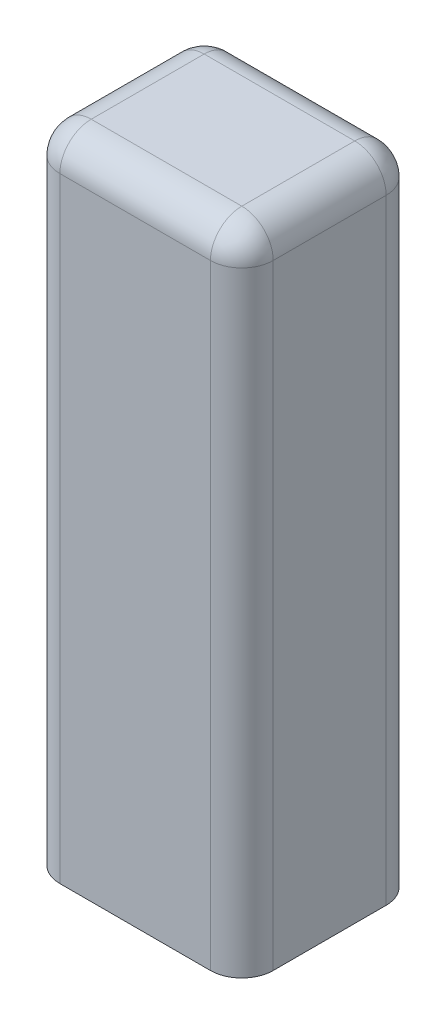
ISO-10303-21;
HEADER;
FILE_DESCRIPTION(('STEP AP214'),'2;1');
FILE_NAME('part.step','',(''),(''),'','','');
FILE_SCHEMA(('AUTOMOTIVE_DESIGN { 1 0 10303 214 1 1 1 1 }'));
ENDSEC;
DATA;
#1=APPLICATION_CONTEXT('core data for automotive mechanical design processes');
#2=APPLICATION_PROTOCOL_DEFINITION('international standard','automotive_design',2000,#1);
#3=PRODUCT_CONTEXT('',#1,'mechanical');
#4=PRODUCT('Part','Part','',(#3));
#5=PRODUCT_RELATED_PRODUCT_CATEGORY('part','',(#4));
#6=PRODUCT_DEFINITION_FORMATION('','',#4);
#7=PRODUCT_DEFINITION_CONTEXT('part definition',#1,'design');
#8=PRODUCT_DEFINITION('design','',#6,#7);
#9=PRODUCT_DEFINITION_SHAPE('','',#8);
#10=(LENGTH_UNIT() NAMED_UNIT(*) SI_UNIT(.MILLI.,.METRE.));
#11=(NAMED_UNIT(*) PLANE_ANGLE_UNIT() SI_UNIT($,.RADIAN.));
#12=(NAMED_UNIT(*) SI_UNIT($,.STERADIAN.) SOLID_ANGLE_UNIT());
#13=UNCERTAINTY_MEASURE_WITH_UNIT(LENGTH_MEASURE(1.E-05),#10,'distance_accuracy_value','');
#14=(GEOMETRIC_REPRESENTATION_CONTEXT(3) GLOBAL_UNCERTAINTY_ASSIGNED_CONTEXT((#13)) GLOBAL_UNIT_ASSIGNED_CONTEXT((#10,
#11,#12)) REPRESENTATION_CONTEXT('',''));
#15=CARTESIAN_POINT('',(0.,0.,0.));
#16=DIRECTION('',(0.,0.,1.));
#17=DIRECTION('',(1.,0.,0.));
#18=AXIS2_PLACEMENT_3D('',#15,#16,#17);
#19=CARTESIAN_POINT('',(39.3425128664854,0.,28.));
#20=DIRECTION('',(0.,1.,0.));
#21=DIRECTION('',(0.,0.,1.));
#22=AXIS2_PLACEMENT_3D('',#19,#20,#21);
#23=PLANE('',#22);
#24=DIRECTION('',(0.,0.,-1.));
#25=VECTOR('',#24,1.);
#26=CARTESIAN_POINT('',(29.,0.,28.));
#27=LINE('',#26,#25);
#28=CARTESIAN_POINT('',(29.,0.,23.));
#29=VERTEX_POINT('',#28);
#30=CARTESIAN_POINT('',(29.,0.,5.));
#31=VERTEX_POINT('',#30);
#32=EDGE_CURVE('E159',#29,#31,#27,.T.);
#33=ORIENTED_EDGE('',*,*,#32,.T.);
#34=DIRECTION('',(1.,0.,0.));
#35=VECTOR('',#34,1.);
#36=CARTESIAN_POINT('',(0.,0.,5.));
#37=LINE('',#36,#35);
#38=CARTESIAN_POINT('',(5.,0.,5.));
#39=VERTEX_POINT('',#38);
#40=EDGE_CURVE('E166',#31,#39,#37,.F.);
#41=ORIENTED_EDGE('',*,*,#40,.T.);
#42=DIRECTION('',(0.,0.,-1.));
#43=VECTOR('',#42,1.);
#44=CARTESIAN_POINT('',(5.,0.,28.));
#45=LINE('',#44,#43);
#46=CARTESIAN_POINT('',(5.,0.,23.));
#47=VERTEX_POINT('',#46);
#48=EDGE_CURVE('E162',#39,#47,#45,.F.);
#49=ORIENTED_EDGE('',*,*,#48,.T.);
#50=DIRECTION('',(1.,0.,0.));
#51=VECTOR('',#50,1.);
#52=CARTESIAN_POINT('',(39.3425128664854,0.,23.));
#53=LINE('',#52,#51);
#54=EDGE_CURVE('E156',#47,#29,#53,.T.);
#55=ORIENTED_EDGE('',*,*,#54,.T.);
#56=EDGE_LOOP('',(#33,#41,#49,#55));
#57=FACE_BOUND('',#56,.T.);
#58=ADVANCED_FACE('F16',(#57),#23,.T.);
#59=CARTESIAN_POINT('',(0.,-75.,28.));
#60=DIRECTION('',(1.,0.,0.));
#61=DIRECTION('',(0.,0.,-1.));
#62=AXIS2_PLACEMENT_3D('',#59,#60,#61);
#63=PLANE('',#62);
#64=DIRECTION('',(0.,0.,-1.));
#65=VECTOR('',#64,1.);
#66=CARTESIAN_POINT('',(0.,-5.,0.));
#67=LINE('',#66,#65);
#68=CARTESIAN_POINT('',(0.,-5.,23.));
#69=VERTEX_POINT('',#68);
#70=CARTESIAN_POINT('',(0.,-5.,5.));
#71=VERTEX_POINT('',#70);
#72=EDGE_CURVE('E146',#69,#71,#67,.T.);
#73=ORIENTED_EDGE('',*,*,#72,.T.);
#74=DIRECTION('',(0.,-1.,0.));
#75=VECTOR('',#74,1.);
#76=CARTESIAN_POINT('',(0.,-75.,5.));
#77=LINE('',#76,#75);
#78=CARTESIAN_POINT('',(0.,-103.,5.));
#79=VERTEX_POINT('',#78);
#80=EDGE_CURVE('E137',#71,#79,#77,.T.);
#81=ORIENTED_EDGE('',*,*,#80,.T.);
#82=DIRECTION('',(0.,0.,-1.));
#83=VECTOR('',#82,1.);
#84=CARTESIAN_POINT('',(0.,-103.,28.));
#85=LINE('',#84,#83);
#86=CARTESIAN_POINT('',(0.,-103.,23.));
#87=VERTEX_POINT('',#86);
#88=EDGE_CURVE('E122',#87,#79,#85,.T.);
#89=ORIENTED_EDGE('',*,*,#88,.F.);
#90=DIRECTION('',(0.,-1.,0.));
#91=VECTOR('',#90,1.);
#92=CARTESIAN_POINT('',(0.,0.,23.));
#93=LINE('',#92,#91);
#94=EDGE_CURVE('E134',#87,#69,#93,.F.);
#95=ORIENTED_EDGE('',*,*,#94,.T.);
#96=EDGE_LOOP('',(#73,#81,#89,#95));
#97=FACE_BOUND('',#96,.T.);
#98=ADVANCED_FACE('F133',(#97),#63,.F.);
#99=CARTESIAN_POINT('',(39.3425128664854,-103.,28.));
#100=DIRECTION('',(0.,1.,0.));
#101=DIRECTION('',(0.,0.,1.));
#102=AXIS2_PLACEMENT_3D('',#99,#100,#101);
#103=PLANE('',#102);
#104=ORIENTED_EDGE('',*,*,#88,.T.);
#105=CARTESIAN_POINT('',(5.,-103.,5.));
#106=DIRECTION('',(0.,1.,0.));
#107=DIRECTION('',(0.,0.,1.));
#108=AXIS2_PLACEMENT_3D('',#105,#106,#107);
#109=CIRCLE('',#108,5.);
#110=CARTESIAN_POINT('',(5.,-103.,0.));
#111=VERTEX_POINT('',#110);
#112=EDGE_CURVE('E182',#79,#111,#109,.F.);
#113=ORIENTED_EDGE('',*,*,#112,.T.);
#114=DIRECTION('',(1.,0.,0.));
#115=VECTOR('',#114,1.);
#116=CARTESIAN_POINT('',(39.3425128664854,-103.,0.));
#117=LINE('',#116,#115);
#118=CARTESIAN_POINT('',(29.,-103.,0.));
#119=VERTEX_POINT('',#118);
#120=EDGE_CURVE('E240',#111,#119,#117,.T.);
#121=ORIENTED_EDGE('',*,*,#120,.T.);
#122=CARTESIAN_POINT('',(29.,-103.,5.));
#123=DIRECTION('',(0.,1.,0.));
#124=DIRECTION('',(0.,0.,1.));
#125=AXIS2_PLACEMENT_3D('',#122,#123,#124);
#126=CIRCLE('',#125,5.);
#127=CARTESIAN_POINT('',(34.,-103.,5.));
#128=VERTEX_POINT('',#127);
#129=EDGE_CURVE('E128',#119,#128,#126,.F.);
#130=ORIENTED_EDGE('',*,*,#129,.T.);
#131=DIRECTION('',(0.,0.,-1.));
#132=VECTOR('',#131,1.);
#133=CARTESIAN_POINT('',(34.,-103.,28.));
#134=LINE('',#133,#132);
#135=CARTESIAN_POINT('',(34.,-103.,23.));
#136=VERTEX_POINT('',#135);
#137=EDGE_CURVE('E139',#136,#128,#134,.T.);
#138=ORIENTED_EDGE('',*,*,#137,.F.);
#139=CARTESIAN_POINT('',(29.,-103.,23.));
#140=DIRECTION('',(0.,1.,0.));
#141=DIRECTION('',(0.,0.,1.));
#142=AXIS2_PLACEMENT_3D('',#139,#140,#141);
#143=CIRCLE('',#142,5.);
#144=CARTESIAN_POINT('',(29.,-103.,28.));
#145=VERTEX_POINT('',#144);
#146=EDGE_CURVE('E129',#136,#145,#143,.F.);
#147=ORIENTED_EDGE('',*,*,#146,.T.);
#148=DIRECTION('',(1.,0.,0.));
#149=VECTOR('',#148,1.);
#150=CARTESIAN_POINT('',(39.3425128664854,-103.,28.));
#151=LINE('',#150,#149);
#152=CARTESIAN_POINT('',(5.,-103.,28.));
#153=VERTEX_POINT('',#152);
#154=EDGE_CURVE('E124',#153,#145,#151,.T.);
#155=ORIENTED_EDGE('',*,*,#154,.F.);
#156=CARTESIAN_POINT('',(5.,-103.,23.));
#157=DIRECTION('',(0.,1.,0.));
#158=DIRECTION('',(0.,0.,1.));
#159=AXIS2_PLACEMENT_3D('',#156,#157,#158);
#160=CIRCLE('',#159,5.);
#161=EDGE_CURVE('E119',#153,#87,#160,.F.);
#162=ORIENTED_EDGE('',*,*,#161,.T.);
#163=EDGE_LOOP('',(#104,#113,#121,#130,#138,#147,#155,#162));
#164=FACE_BOUND('',#163,.T.);
#165=ADVANCED_FACE('F121',(#164),#103,.F.);
#166=CARTESIAN_POINT('',(34.,-75.,28.));
#167=DIRECTION('',(1.,0.,0.));
#168=DIRECTION('',(0.,1.,0.));
#169=AXIS2_PLACEMENT_3D('',#166,#167,#168);
#170=PLANE('',#169);
#171=ORIENTED_EDGE('',*,*,#137,.T.);
#172=DIRECTION('',(0.,-1.,0.));
#173=VECTOR('',#172,1.);
#174=CARTESIAN_POINT('',(34.,0.,5.));
#175=LINE('',#174,#173);
#176=CARTESIAN_POINT('',(34.,-5.,5.));
#177=VERTEX_POINT('',#176);
#178=EDGE_CURVE('E175',#128,#177,#175,.F.);
#179=ORIENTED_EDGE('',*,*,#178,.T.);
#180=DIRECTION('',(0.,0.,-1.));
#181=VECTOR('',#180,1.);
#182=CARTESIAN_POINT('',(34.,-5.,28.));
#183=LINE('',#182,#181);
#184=CARTESIAN_POINT('',(34.,-5.,23.));
#185=VERTEX_POINT('',#184);
#186=EDGE_CURVE('E172',#177,#185,#183,.F.);
#187=ORIENTED_EDGE('',*,*,#186,.T.);
#188=DIRECTION('',(0.,-1.,0.));
#189=VECTOR('',#188,1.);
#190=CARTESIAN_POINT('',(34.,-75.,23.));
#191=LINE('',#190,#189);
#192=EDGE_CURVE('E169',#185,#136,#191,.T.);
#193=ORIENTED_EDGE('',*,*,#192,.T.);
#194=EDGE_LOOP('',(#171,#179,#187,#193));
#195=FACE_BOUND('',#194,.T.);
#196=ADVANCED_FACE('F257',(#195),#170,.T.);
#197=CARTESIAN_POINT('',(17.,-51.5,28.));
#198=DIRECTION('',(0.,0.,1.));
#199=DIRECTION('',(1.,0.,0.));
#200=AXIS2_PLACEMENT_3D('',#197,#198,#199);
#201=PLANE('',#200);
#202=DIRECTION('',(1.,0.,0.));
#203=VECTOR('',#202,1.);
#204=CARTESIAN_POINT('',(17.,-5.,28.));
#205=LINE('',#204,#203);
#206=CARTESIAN_POINT('',(29.,-5.,28.));
#207=VERTEX_POINT('',#206);
#208=CARTESIAN_POINT('',(5.,-5.,28.));
#209=VERTEX_POINT('',#208);
#210=EDGE_CURVE('E26',#207,#209,#205,.F.);
#211=ORIENTED_EDGE('',*,*,#210,.T.);
#212=DIRECTION('',(0.,-1.,0.));
#213=VECTOR('',#212,1.);
#214=CARTESIAN_POINT('',(5.,-103.,28.));
#215=LINE('',#214,#213);
#216=EDGE_CURVE('E10',#209,#153,#215,.T.);
#217=ORIENTED_EDGE('',*,*,#216,.T.);
#218=ORIENTED_EDGE('',*,*,#154,.T.);
#219=DIRECTION('',(0.,-1.,0.));
#220=VECTOR('',#219,1.);
#221=CARTESIAN_POINT('',(29.,-51.5,28.));
#222=LINE('',#221,#220);
#223=EDGE_CURVE('E46',#145,#207,#222,.F.);
#224=ORIENTED_EDGE('',*,*,#223,.T.);
#225=EDGE_LOOP('',(#211,#217,#218,#224));
#226=FACE_BOUND('',#225,.T.);
#227=ADVANCED_FACE('F274',(#226),#201,.T.);
#228=CARTESIAN_POINT('',(17.,-51.5,0.));
#229=DIRECTION('',(0.,0.,1.));
#230=DIRECTION('',(1.,0.,0.));
#231=AXIS2_PLACEMENT_3D('',#228,#229,#230);
#232=PLANE('',#231);
#233=ORIENTED_EDGE('',*,*,#120,.F.);
#234=DIRECTION('',(0.,-1.,0.));
#235=VECTOR('',#234,1.);
#236=CARTESIAN_POINT('',(5.,-51.5,0.));
#237=LINE('',#236,#235);
#238=CARTESIAN_POINT('',(5.,-5.,0.));
#239=VERTEX_POINT('',#238);
#240=EDGE_CURVE('E190',#111,#239,#237,.F.);
#241=ORIENTED_EDGE('',*,*,#240,.T.);
#242=DIRECTION('',(1.,0.,0.));
#243=VECTOR('',#242,1.);
#244=CARTESIAN_POINT('',(34.,-5.,0.));
#245=LINE('',#244,#243);
#246=CARTESIAN_POINT('',(29.,-5.,0.));
#247=VERTEX_POINT('',#246);
#248=EDGE_CURVE('E187',#239,#247,#245,.T.);
#249=ORIENTED_EDGE('',*,*,#248,.T.);
#250=DIRECTION('',(0.,-1.,0.));
#251=VECTOR('',#250,1.);
#252=CARTESIAN_POINT('',(29.,-103.,0.));
#253=LINE('',#252,#251);
#254=EDGE_CURVE('E185',#247,#119,#253,.T.);
#255=ORIENTED_EDGE('',*,*,#254,.T.);
#256=EDGE_LOOP('',(#233,#241,#249,#255));
#257=FACE_BOUND('',#256,.T.);
#258=ADVANCED_FACE('F294',(#257),#232,.F.);
#259=CARTESIAN_POINT('',(29.,-75.,23.));
#260=DIRECTION('',(0.,-1.,0.));
#261=DIRECTION('',(1.,0.,0.));
#262=AXIS2_PLACEMENT_3D('',#259,#260,#261);
#263=CYLINDRICAL_SURFACE('',#262,5.);
#264=ORIENTED_EDGE('',*,*,#146,.F.);
#265=ORIENTED_EDGE('',*,*,#192,.F.);
#266=CARTESIAN_POINT('',(29.,-5.,23.));
#267=DIRECTION('',(0.,1.,0.));
#268=DIRECTION('',(0.,0.,1.));
#269=AXIS2_PLACEMENT_3D('',#266,#267,#268);
#270=CIRCLE('',#269,5.);
#271=EDGE_CURVE('E232',#207,#185,#270,.T.);
#272=ORIENTED_EDGE('',*,*,#271,.F.);
#273=ORIENTED_EDGE('',*,*,#223,.F.);
#274=EDGE_LOOP('',(#264,#265,#272,#273));
#275=FACE_BOUND('',#274,.T.);
#276=ADVANCED_FACE('F18',(#275),#263,.T.);
#277=CARTESIAN_POINT('',(29.,-51.5,5.));
#278=DIRECTION('',(0.,1.,0.));
#279=DIRECTION('',(-1.,0.,0.));
#280=AXIS2_PLACEMENT_3D('',#277,#278,#279);
#281=CYLINDRICAL_SURFACE('',#280,5.);
#282=ORIENTED_EDGE('',*,*,#129,.F.);
#283=ORIENTED_EDGE('',*,*,#254,.F.);
#284=CARTESIAN_POINT('',(29.,-5.,5.));
#285=DIRECTION('',(0.,1.,0.));
#286=DIRECTION('',(0.,0.,1.));
#287=AXIS2_PLACEMENT_3D('',#284,#285,#286);
#288=CIRCLE('',#287,5.);
#289=EDGE_CURVE('E229',#177,#247,#288,.T.);
#290=ORIENTED_EDGE('',*,*,#289,.F.);
#291=ORIENTED_EDGE('',*,*,#178,.F.);
#292=EDGE_LOOP('',(#282,#283,#290,#291));
#293=FACE_BOUND('',#292,.T.);
#294=ADVANCED_FACE('F263',(#293),#281,.T.);
#295=CARTESIAN_POINT('',(29.,-5.,28.));
#296=DIRECTION('',(0.,0.,-1.));
#297=DIRECTION('',(-1.,0.,0.));
#298=AXIS2_PLACEMENT_3D('',#295,#296,#297);
#299=CYLINDRICAL_SURFACE('',#298,5.);
#300=CARTESIAN_POINT('',(29.,-5.,23.));
#301=DIRECTION('',(0.,0.,1.));
#302=DIRECTION('',(1.,0.,0.));
#303=AXIS2_PLACEMENT_3D('',#300,#301,#302);
#304=CIRCLE('',#303,5.);
#305=EDGE_CURVE('E20',#185,#29,#304,.T.);
#306=ORIENTED_EDGE('',*,*,#305,.F.);
#307=ORIENTED_EDGE('',*,*,#186,.F.);
#308=CARTESIAN_POINT('',(29.,-5.,5.));
#309=DIRECTION('',(0.,0.,-1.));
#310=DIRECTION('',(-1.,0.,0.));
#311=AXIS2_PLACEMENT_3D('',#308,#309,#310);
#312=CIRCLE('',#311,5.);
#313=EDGE_CURVE('E225',#31,#177,#312,.T.);
#314=ORIENTED_EDGE('',*,*,#313,.F.);
#315=ORIENTED_EDGE('',*,*,#32,.F.);
#316=EDGE_LOOP('',(#306,#307,#314,#315));
#317=FACE_BOUND('',#316,.T.);
#318=ADVANCED_FACE('F272',(#317),#299,.T.);
#319=CARTESIAN_POINT('',(29.,-5.,23.));
#320=DIRECTION('',(0.,0.,1.));
#321=DIRECTION('',(1.,0.,0.));
#322=AXIS2_PLACEMENT_3D('',#319,#320,#321);
#323=SPHERICAL_SURFACE('',#322,5.);
#324=ORIENTED_EDGE('',*,*,#271,.T.);
#325=ORIENTED_EDGE('',*,*,#305,.T.);
#326=CARTESIAN_POINT('',(29.,-5.,23.));
#327=DIRECTION('',(1.,0.,0.));
#328=DIRECTION('',(0.,0.,-1.));
#329=AXIS2_PLACEMENT_3D('',#326,#327,#328);
#330=CIRCLE('',#329,5.);
#331=EDGE_CURVE('E221',#207,#29,#330,.F.);
#332=ORIENTED_EDGE('',*,*,#331,.F.);
#333=EDGE_LOOP('',(#324,#325,#332));
#334=FACE_BOUND('',#333,.T.);
#335=ADVANCED_FACE('F324',(#334),#323,.T.);
#336=CARTESIAN_POINT('',(29.,-5.,5.));
#337=DIRECTION('',(0.,0.,1.));
#338=DIRECTION('',(1.,0.,0.));
#339=AXIS2_PLACEMENT_3D('',#336,#337,#338);
#340=SPHERICAL_SURFACE('',#339,5.);
#341=ORIENTED_EDGE('',*,*,#313,.T.);
#342=ORIENTED_EDGE('',*,*,#289,.T.);
#343=CARTESIAN_POINT('',(29.,-5.,5.));
#344=DIRECTION('',(1.,0.,0.));
#345=DIRECTION('',(0.,1.,0.));
#346=AXIS2_PLACEMENT_3D('',#343,#344,#345);
#347=CIRCLE('',#346,5.);
#348=EDGE_CURVE('E217',#31,#247,#347,.F.);
#349=ORIENTED_EDGE('',*,*,#348,.F.);
#350=EDGE_LOOP('',(#341,#342,#349));
#351=FACE_BOUND('',#350,.T.);
#352=ADVANCED_FACE('F268',(#351),#340,.T.);
#353=CARTESIAN_POINT('',(39.3425128664854,-5.,23.));
#354=DIRECTION('',(1.,0.,0.));
#355=DIRECTION('',(0.,0.,-1.));
#356=AXIS2_PLACEMENT_3D('',#353,#354,#355);
#357=CYLINDRICAL_SURFACE('',#356,5.);
#358=ORIENTED_EDGE('',*,*,#331,.T.);
#359=ORIENTED_EDGE('',*,*,#54,.F.);
#360=CARTESIAN_POINT('',(5.,-5.,23.));
#361=DIRECTION('',(-1.,0.,0.));
#362=DIRECTION('',(0.,-1.,0.));
#363=AXIS2_PLACEMENT_3D('',#360,#361,#362);
#364=CIRCLE('',#363,5.);
#365=EDGE_CURVE('E213',#209,#47,#364,.T.);
#366=ORIENTED_EDGE('',*,*,#365,.F.);
#367=ORIENTED_EDGE('',*,*,#210,.F.);
#368=EDGE_LOOP('',(#358,#359,#366,#367));
#369=FACE_BOUND('',#368,.T.);
#370=ADVANCED_FACE('F278',(#369),#357,.T.);
#371=CARTESIAN_POINT('',(5.,-51.5,23.));
#372=DIRECTION('',(0.,1.,0.));
#373=DIRECTION('',(0.,0.,1.));
#374=AXIS2_PLACEMENT_3D('',#371,#372,#373);
#375=CYLINDRICAL_SURFACE('',#374,5.);
#376=ORIENTED_EDGE('',*,*,#161,.F.);
#377=ORIENTED_EDGE('',*,*,#216,.F.);
#378=CARTESIAN_POINT('',(5.,-5.,23.));
#379=DIRECTION('',(0.,1.,0.));
#380=DIRECTION('',(0.,0.,1.));
#381=AXIS2_PLACEMENT_3D('',#378,#379,#380);
#382=CIRCLE('',#381,5.);
#383=EDGE_CURVE('E143',#69,#209,#382,.T.);
#384=ORIENTED_EDGE('',*,*,#383,.F.);
#385=ORIENTED_EDGE('',*,*,#94,.F.);
#386=EDGE_LOOP('',(#376,#377,#384,#385));
#387=FACE_BOUND('',#386,.T.);
#388=ADVANCED_FACE('F141',(#387),#375,.T.);
#389=CARTESIAN_POINT('',(5.,-75.,5.));
#390=DIRECTION('',(0.,-1.,0.));
#391=DIRECTION('',(0.,0.,-1.));
#392=AXIS2_PLACEMENT_3D('',#389,#390,#391);
#393=CYLINDRICAL_SURFACE('',#392,5.);
#394=ORIENTED_EDGE('',*,*,#112,.F.);
#395=ORIENTED_EDGE('',*,*,#80,.F.);
#396=CARTESIAN_POINT('',(5.,-5.,5.));
#397=DIRECTION('',(0.,1.,0.));
#398=DIRECTION('',(-1.,0.,0.));
#399=AXIS2_PLACEMENT_3D('',#396,#397,#398);
#400=CIRCLE('',#399,5.);
#401=EDGE_CURVE('E207',#239,#71,#400,.T.);
#402=ORIENTED_EDGE('',*,*,#401,.F.);
#403=ORIENTED_EDGE('',*,*,#240,.F.);
#404=EDGE_LOOP('',(#394,#395,#402,#403));
#405=FACE_BOUND('',#404,.T.);
#406=ADVANCED_FACE('F292',(#405),#393,.T.);
#407=CARTESIAN_POINT('',(17.,-5.,5.));
#408=DIRECTION('',(-1.,0.,0.));
#409=DIRECTION('',(0.,0.,1.));
#410=AXIS2_PLACEMENT_3D('',#407,#408,#409);
#411=CYLINDRICAL_SURFACE('',#410,5.);
#412=ORIENTED_EDGE('',*,*,#348,.T.);
#413=ORIENTED_EDGE('',*,*,#248,.F.);
#414=CARTESIAN_POINT('',(5.,-5.,5.));
#415=DIRECTION('',(-1.,0.,0.));
#416=DIRECTION('',(0.,0.,1.));
#417=AXIS2_PLACEMENT_3D('',#414,#415,#416);
#418=CIRCLE('',#417,5.);
#419=EDGE_CURVE('E203',#39,#239,#418,.T.);
#420=ORIENTED_EDGE('',*,*,#419,.F.);
#421=ORIENTED_EDGE('',*,*,#40,.F.);
#422=EDGE_LOOP('',(#412,#413,#420,#421));
#423=FACE_BOUND('',#422,.T.);
#424=ADVANCED_FACE('F297',(#423),#411,.T.);
#425=CARTESIAN_POINT('',(5.,-5.,23.));
#426=DIRECTION('',(0.,0.,1.));
#427=DIRECTION('',(1.,0.,0.));
#428=AXIS2_PLACEMENT_3D('',#425,#426,#427);
#429=SPHERICAL_SURFACE('',#428,5.);
#430=ORIENTED_EDGE('',*,*,#383,.T.);
#431=ORIENTED_EDGE('',*,*,#365,.T.);
#432=CARTESIAN_POINT('',(5.,-5.,23.));
#433=DIRECTION('',(0.,0.,1.));
#434=DIRECTION('',(1.,0.,0.));
#435=AXIS2_PLACEMENT_3D('',#432,#433,#434);
#436=CIRCLE('',#435,5.);
#437=EDGE_CURVE('E200',#69,#47,#436,.F.);
#438=ORIENTED_EDGE('',*,*,#437,.F.);
#439=EDGE_LOOP('',(#430,#431,#438));
#440=FACE_BOUND('',#439,.T.);
#441=ADVANCED_FACE('F280',(#440),#429,.T.);
#442=CARTESIAN_POINT('',(5.,-5.,5.));
#443=DIRECTION('',(0.,0.,1.));
#444=DIRECTION('',(1.,0.,0.));
#445=AXIS2_PLACEMENT_3D('',#442,#443,#444);
#446=SPHERICAL_SURFACE('',#445,5.);
#447=ORIENTED_EDGE('',*,*,#419,.T.);
#448=ORIENTED_EDGE('',*,*,#401,.T.);
#449=CARTESIAN_POINT('',(5.,-5.,5.));
#450=DIRECTION('',(0.,0.,-1.));
#451=DIRECTION('',(0.,1.,0.));
#452=AXIS2_PLACEMENT_3D('',#449,#450,#451);
#453=CIRCLE('',#452,5.);
#454=EDGE_CURVE('E197',#39,#71,#453,.F.);
#455=ORIENTED_EDGE('',*,*,#454,.F.);
#456=EDGE_LOOP('',(#447,#448,#455));
#457=FACE_BOUND('',#456,.T.);
#458=ADVANCED_FACE('F288',(#457),#446,.T.);
#459=CARTESIAN_POINT('',(5.,-5.,28.));
#460=DIRECTION('',(0.,0.,1.));
#461=DIRECTION('',(1.,0.,0.));
#462=AXIS2_PLACEMENT_3D('',#459,#460,#461);
#463=CYLINDRICAL_SURFACE('',#462,5.);
#464=ORIENTED_EDGE('',*,*,#437,.T.);
#465=ORIENTED_EDGE('',*,*,#48,.F.);
#466=ORIENTED_EDGE('',*,*,#454,.T.);
#467=ORIENTED_EDGE('',*,*,#72,.F.);
#468=EDGE_LOOP('',(#464,#465,#466,#467));
#469=FACE_BOUND('',#468,.T.);
#470=ADVANCED_FACE('F284',(#469),#463,.T.);
#471=CLOSED_SHELL('',(#58,#98,#165,#196,#227,#258,#276,#294,#318,#335,#352,#370,#388,#406,#424,
#441,#458,#470));
#472=MANIFOLD_SOLID_BREP('B1',#471);
#473=ADVANCED_BREP_SHAPE_REPRESENTATION('',(#18,#472),#14);
#474=SHAPE_DEFINITION_REPRESENTATION(#9,#473);
ENDSEC;
END-ISO-10303-21;
